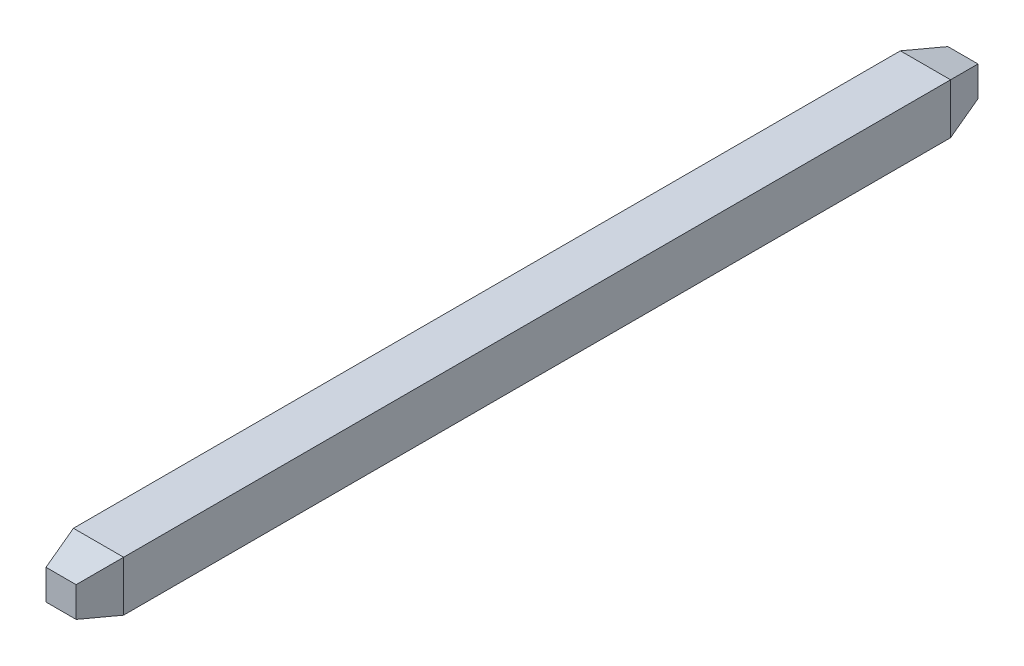
ISO-10303-21;
HEADER;
FILE_DESCRIPTION(('STEP AP214'),'2;1');
FILE_NAME('part.step','',(''),(''),'','','');
FILE_SCHEMA(('AUTOMOTIVE_DESIGN { 1 0 10303 214 1 1 1 1 }'));
ENDSEC;
DATA;
#1=APPLICATION_CONTEXT('core data for automotive mechanical design processes');
#2=APPLICATION_PROTOCOL_DEFINITION('international standard','automotive_design',2000,#1);
#3=PRODUCT_CONTEXT('',#1,'mechanical');
#4=PRODUCT('Part','Part','',(#3));
#5=PRODUCT_RELATED_PRODUCT_CATEGORY('part','',(#4));
#6=PRODUCT_DEFINITION_FORMATION('','',#4);
#7=PRODUCT_DEFINITION_CONTEXT('part definition',#1,'design');
#8=PRODUCT_DEFINITION('design','',#6,#7);
#9=PRODUCT_DEFINITION_SHAPE('','',#8);
#10=(LENGTH_UNIT() NAMED_UNIT(*) SI_UNIT(.MILLI.,.METRE.));
#11=(NAMED_UNIT(*) PLANE_ANGLE_UNIT() SI_UNIT($,.RADIAN.));
#12=(NAMED_UNIT(*) SI_UNIT($,.STERADIAN.) SOLID_ANGLE_UNIT());
#13=UNCERTAINTY_MEASURE_WITH_UNIT(LENGTH_MEASURE(1.E-05),#10,'distance_accuracy_value','');
#14=(GEOMETRIC_REPRESENTATION_CONTEXT(3) GLOBAL_UNCERTAINTY_ASSIGNED_CONTEXT((#13)) GLOBAL_UNIT_ASSIGNED_CONTEXT((#10,
#11,#12)) REPRESENTATION_CONTEXT('',''));
#15=CARTESIAN_POINT('',(0.,0.,0.));
#16=DIRECTION('',(0.,0.,1.));
#17=DIRECTION('',(1.,0.,0.));
#18=AXIS2_PLACEMENT_3D('',#15,#16,#17);
#19=CARTESIAN_POINT('',(6.08859499326237,2.21999999999989,7.92229749663118));
#20=DIRECTION('',(0.,-0.965925826289069,0.25881904510252));
#21=DIRECTION('',(0.,-0.25881904510252,-0.965925826289069));
#22=AXIS2_PLACEMENT_3D('',#19,#20,#21);
#23=PLANE('',#22);
#24=DIRECTION('',(1.,0.,0.));
#25=VECTOR('',#24,1.);
#26=CARTESIAN_POINT('',(7.62,2.34799999999989,8.4));
#27=LINE('',#26,#25);
#28=CARTESIAN_POINT('',(7.428,2.34799999999989,8.4));
#29=VERTEX_POINT('',#28);
#30=CARTESIAN_POINT('',(7.812,2.34799999999989,8.4));
#31=VERTEX_POINT('',#30);
#32=EDGE_CURVE('E20',#29,#31,#27,.T.);
#33=ORIENTED_EDGE('',*,*,#32,.F.);
#34=DIRECTION('',(0.250562807085731,0.25056280708573,0.93511312653103));
#35=VECTOR('',#34,1.);
#36=CARTESIAN_POINT('',(7.3,2.21999999999989,7.92229749663118));
#37=LINE('',#36,#35);
#38=CARTESIAN_POINT('',(7.3,2.21999999999989,7.92229749663118));
#39=VERTEX_POINT('',#38);
#40=EDGE_CURVE('E110',#39,#29,#37,.T.);
#41=ORIENTED_EDGE('',*,*,#40,.F.);
#42=DIRECTION('',(1.,0.,0.));
#43=VECTOR('',#42,1.);
#44=CARTESIAN_POINT('',(7.3,2.21999999999989,7.92229749663118));
#45=LINE('',#44,#43);
#46=CARTESIAN_POINT('',(7.94,2.21999999999989,7.92229749663118));
#47=VERTEX_POINT('',#46);
#48=EDGE_CURVE('E96',#47,#39,#45,.F.);
#49=ORIENTED_EDGE('',*,*,#48,.F.);
#50=DIRECTION('',(0.250562807085732,-0.25056280708573,-0.93511312653103));
#51=VECTOR('',#50,1.);
#52=CARTESIAN_POINT('',(7.812,2.34799999999989,8.4));
#53=LINE('',#52,#51);
#54=EDGE_CURVE('E94',#31,#47,#53,.T.);
#55=ORIENTED_EDGE('',*,*,#54,.F.);
#56=EDGE_LOOP('',(#33,#41,#49,#55));
#57=FACE_BOUND('',#56,.T.);
#58=ADVANCED_FACE('F17',(#57),#23,.T.);
#59=CARTESIAN_POINT('',(6.08859499326237,2.21999999999989,-2.62229749663118));
#60=DIRECTION('',(0.,0.965925826289068,0.258819045102521));
#61=DIRECTION('',(0.,-0.258819045102521,0.965925826289068));
#62=AXIS2_PLACEMENT_3D('',#59,#60,#61);
#63=PLANE('',#62);
#64=DIRECTION('',(0.250562807085733,0.25056280708573,-0.93511312653103));
#65=VECTOR('',#64,1.);
#66=CARTESIAN_POINT('',(7.3,2.21999999999989,-2.62229749663118));
#67=LINE('',#66,#65);
#68=CARTESIAN_POINT('',(7.3,2.21999999999989,-2.62229749663118));
#69=VERTEX_POINT('',#68);
#70=CARTESIAN_POINT('',(7.428,2.34799999999989,-3.1));
#71=VERTEX_POINT('',#70);
#72=EDGE_CURVE('E113',#69,#71,#67,.T.);
#73=ORIENTED_EDGE('',*,*,#72,.T.);
#74=DIRECTION('',(1.,0.,0.));
#75=VECTOR('',#74,1.);
#76=CARTESIAN_POINT('',(7.62,2.34799999999989,-3.1));
#77=LINE('',#76,#75);
#78=CARTESIAN_POINT('',(7.812,2.34799999999989,-3.1));
#79=VERTEX_POINT('',#78);
#80=EDGE_CURVE('E79',#71,#79,#77,.T.);
#81=ORIENTED_EDGE('',*,*,#80,.T.);
#82=DIRECTION('',(0.250562807085734,-0.25056280708573,0.935113126531029));
#83=VECTOR('',#82,1.);
#84=CARTESIAN_POINT('',(7.812,2.34799999999989,-3.1));
#85=LINE('',#84,#83);
#86=CARTESIAN_POINT('',(7.94,2.21999999999989,-2.62229749663118));
#87=VERTEX_POINT('',#86);
#88=EDGE_CURVE('E108',#79,#87,#85,.T.);
#89=ORIENTED_EDGE('',*,*,#88,.T.);
#90=DIRECTION('',(1.,0.,0.));
#91=VECTOR('',#90,1.);
#92=CARTESIAN_POINT('',(7.3,2.21999999999989,-2.62229749663118));
#93=LINE('',#92,#91);
#94=EDGE_CURVE('E118',#69,#87,#93,.T.);
#95=ORIENTED_EDGE('',*,*,#94,.F.);
#96=EDGE_LOOP('',(#73,#81,#89,#95));
#97=FACE_BOUND('',#96,.T.);
#98=ADVANCED_FACE('F281',(#97),#63,.F.);
#99=CARTESIAN_POINT('',(7.62,2.53999999999989,8.4));
#100=DIRECTION('',(0.,0.,1.));
#101=DIRECTION('',(1.,0.,0.));
#102=AXIS2_PLACEMENT_3D('',#99,#100,#101);
#103=PLANE('',#102);
#104=ORIENTED_EDGE('',*,*,#32,.T.);
#105=DIRECTION('',(0.,1.,0.));
#106=VECTOR('',#105,1.);
#107=CARTESIAN_POINT('',(7.812,1.00859499326226,8.4));
#108=LINE('',#107,#106);
#109=CARTESIAN_POINT('',(7.812,2.73199999999989,8.4));
#110=VERTEX_POINT('',#109);
#111=EDGE_CURVE('E88',#110,#31,#108,.F.);
#112=ORIENTED_EDGE('',*,*,#111,.F.);
#113=DIRECTION('',(1.,0.,0.));
#114=VECTOR('',#113,1.);
#115=CARTESIAN_POINT('',(9.15140500673763,2.73199999999989,8.4));
#116=LINE('',#115,#114);
#117=CARTESIAN_POINT('',(7.428,2.73199999999989,8.4));
#118=VERTEX_POINT('',#117);
#119=EDGE_CURVE('E124',#118,#110,#116,.T.);
#120=ORIENTED_EDGE('',*,*,#119,.F.);
#121=DIRECTION('',(0.,1.,0.));
#122=VECTOR('',#121,1.);
#123=CARTESIAN_POINT('',(7.428,4.07140500673752,8.4));
#124=LINE('',#123,#122);
#125=EDGE_CURVE('E90',#29,#118,#124,.T.);
#126=ORIENTED_EDGE('',*,*,#125,.F.);
#127=EDGE_LOOP('',(#104,#112,#120,#126));
#128=FACE_BOUND('',#127,.T.);
#129=ADVANCED_FACE('F85',(#128),#103,.T.);
#130=CARTESIAN_POINT('',(7.94,1.00859499326226,7.92229749663118));
#131=DIRECTION('',(0.965925826289069,0.,0.25881904510252));
#132=DIRECTION('',(0.25881904510252,0.,-0.965925826289069));
#133=AXIS2_PLACEMENT_3D('',#130,#131,#132);
#134=PLANE('',#133);
#135=ORIENTED_EDGE('',*,*,#111,.T.);
#136=ORIENTED_EDGE('',*,*,#54,.T.);
#137=DIRECTION('',(0.,1.,0.));
#138=VECTOR('',#137,1.);
#139=CARTESIAN_POINT('',(7.94,2.21999999999989,7.92229749663118));
#140=LINE('',#139,#138);
#141=CARTESIAN_POINT('',(7.94,2.85999999999989,7.92229749663118));
#142=VERTEX_POINT('',#141);
#143=EDGE_CURVE('E127',#142,#47,#140,.F.);
#144=ORIENTED_EDGE('',*,*,#143,.F.);
#145=DIRECTION('',(0.25056280708573,0.25056280708573,-0.93511312653103));
#146=VECTOR('',#145,1.);
#147=CARTESIAN_POINT('',(7.812,2.73199999999989,8.4));
#148=LINE('',#147,#146);
#149=EDGE_CURVE('E102',#110,#142,#148,.T.);
#150=ORIENTED_EDGE('',*,*,#149,.F.);
#151=EDGE_LOOP('',(#135,#136,#144,#150));
#152=FACE_BOUND('',#151,.T.);
#153=ADVANCED_FACE('F100',(#152),#134,.T.);
#154=CARTESIAN_POINT('',(7.62,2.53999999999989,-3.1));
#155=DIRECTION('',(0.,0.,1.));
#156=DIRECTION('',(1.,0.,0.));
#157=AXIS2_PLACEMENT_3D('',#154,#155,#156);
#158=PLANE('',#157);
#159=DIRECTION('',(0.,1.,0.));
#160=VECTOR('',#159,1.);
#161=CARTESIAN_POINT('',(7.812,1.00859499326226,-3.1));
#162=LINE('',#161,#160);
#163=CARTESIAN_POINT('',(7.812,2.73199999999989,-3.1));
#164=VERTEX_POINT('',#163);
#165=EDGE_CURVE('E106',#164,#79,#162,.F.);
#166=ORIENTED_EDGE('',*,*,#165,.T.);
#167=ORIENTED_EDGE('',*,*,#80,.F.);
#168=DIRECTION('',(0.,1.,0.));
#169=VECTOR('',#168,1.);
#170=CARTESIAN_POINT('',(7.428,4.07140500673752,-3.1));
#171=LINE('',#170,#169);
#172=CARTESIAN_POINT('',(7.428,2.73199999999989,-3.1));
#173=VERTEX_POINT('',#172);
#174=EDGE_CURVE('E115',#71,#173,#171,.T.);
#175=ORIENTED_EDGE('',*,*,#174,.T.);
#176=DIRECTION('',(1.,0.,0.));
#177=VECTOR('',#176,1.);
#178=CARTESIAN_POINT('',(9.15140500673763,2.73199999999989,-3.1));
#179=LINE('',#178,#177);
#180=EDGE_CURVE('E138',#173,#164,#179,.T.);
#181=ORIENTED_EDGE('',*,*,#180,.T.);
#182=EDGE_LOOP('',(#166,#167,#175,#181));
#183=FACE_BOUND('',#182,.T.);
#184=ADVANCED_FACE('F257',(#183),#158,.F.);
#185=CARTESIAN_POINT('',(7.94,1.00859499326226,-2.62229749663118));
#186=DIRECTION('',(-0.965925826289068,0.,0.258819045102521));
#187=DIRECTION('',(0.258819045102521,0.,0.965925826289068));
#188=AXIS2_PLACEMENT_3D('',#185,#186,#187);
#189=PLANE('',#188);
#190=ORIENTED_EDGE('',*,*,#88,.F.);
#191=ORIENTED_EDGE('',*,*,#165,.F.);
#192=DIRECTION('',(0.25056280708573,0.250562807085732,0.93511312653103));
#193=VECTOR('',#192,1.);
#194=CARTESIAN_POINT('',(7.812,2.73199999999989,-3.1));
#195=LINE('',#194,#193);
#196=CARTESIAN_POINT('',(7.94,2.85999999999989,-2.62229749663118));
#197=VERTEX_POINT('',#196);
#198=EDGE_CURVE('E140',#164,#197,#195,.T.);
#199=ORIENTED_EDGE('',*,*,#198,.T.);
#200=DIRECTION('',(0.,1.,0.));
#201=VECTOR('',#200,1.);
#202=CARTESIAN_POINT('',(7.94,2.21999999999989,-2.62229749663118));
#203=LINE('',#202,#201);
#204=EDGE_CURVE('E133',#87,#197,#203,.T.);
#205=ORIENTED_EDGE('',*,*,#204,.F.);
#206=EDGE_LOOP('',(#190,#191,#199,#205));
#207=FACE_BOUND('',#206,.T.);
#208=ADVANCED_FACE('F249',(#207),#189,.F.);
#209=CARTESIAN_POINT('',(7.3,4.07140500673752,7.92229749663118));
#210=DIRECTION('',(-0.965925826289069,0.,0.25881904510252));
#211=DIRECTION('',(0.25881904510252,0.,0.965925826289069));
#212=AXIS2_PLACEMENT_3D('',#209,#210,#211);
#213=PLANE('',#212);
#214=ORIENTED_EDGE('',*,*,#125,.T.);
#215=DIRECTION('',(0.250562807085729,-0.250562807085731,0.93511312653103));
#216=VECTOR('',#215,1.);
#217=CARTESIAN_POINT('',(7.3,2.85999999999989,7.92229749663118));
#218=LINE('',#217,#216);
#219=CARTESIAN_POINT('',(7.3,2.85999999999989,7.92229749663118));
#220=VERTEX_POINT('',#219);
#221=EDGE_CURVE('E121',#220,#118,#218,.T.);
#222=ORIENTED_EDGE('',*,*,#221,.F.);
#223=DIRECTION('',(0.,-1.,0.));
#224=VECTOR('',#223,1.);
#225=CARTESIAN_POINT('',(7.3,2.85999999999989,7.92229749663118));
#226=LINE('',#225,#224);
#227=EDGE_CURVE('E142',#39,#220,#226,.F.);
#228=ORIENTED_EDGE('',*,*,#227,.F.);
#229=ORIENTED_EDGE('',*,*,#40,.T.);
#230=EDGE_LOOP('',(#214,#222,#228,#229));
#231=FACE_BOUND('',#230,.T.);
#232=ADVANCED_FACE('F171',(#231),#213,.T.);
#233=CARTESIAN_POINT('',(7.3,4.07140500673752,-2.62229749663118));
#234=DIRECTION('',(0.965925826289068,0.,0.258819045102521));
#235=DIRECTION('',(0.258819045102521,0.,-0.965925826289068));
#236=AXIS2_PLACEMENT_3D('',#233,#234,#235);
#237=PLANE('',#236);
#238=DIRECTION('',(0.250562807085729,-0.250562807085732,-0.93511312653103));
#239=VECTOR('',#238,1.);
#240=CARTESIAN_POINT('',(7.3,2.85999999999989,-2.62229749663118));
#241=LINE('',#240,#239);
#242=CARTESIAN_POINT('',(7.3,2.85999999999989,-2.62229749663118));
#243=VERTEX_POINT('',#242);
#244=EDGE_CURVE('E136',#243,#173,#241,.T.);
#245=ORIENTED_EDGE('',*,*,#244,.T.);
#246=ORIENTED_EDGE('',*,*,#174,.F.);
#247=ORIENTED_EDGE('',*,*,#72,.F.);
#248=DIRECTION('',(0.,-1.,0.));
#249=VECTOR('',#248,1.);
#250=CARTESIAN_POINT('',(7.3,2.85999999999989,-2.62229749663118));
#251=LINE('',#250,#249);
#252=EDGE_CURVE('E35',#243,#69,#251,.T.);
#253=ORIENTED_EDGE('',*,*,#252,.F.);
#254=EDGE_LOOP('',(#245,#246,#247,#253));
#255=FACE_BOUND('',#254,.T.);
#256=ADVANCED_FACE('F188',(#255),#237,.F.);
#257=CARTESIAN_POINT('',(7.3,2.21999999999989,-3.1));
#258=DIRECTION('',(0.,-1.,0.));
#259=DIRECTION('',(1.,0.,0.));
#260=AXIS2_PLACEMENT_3D('',#257,#258,#259);
#261=PLANE('',#260);
#262=ORIENTED_EDGE('',*,*,#94,.T.);
#263=DIRECTION('',(0.,0.,1.));
#264=VECTOR('',#263,1.);
#265=CARTESIAN_POINT('',(7.94,2.21999999999989,-3.1));
#266=LINE('',#265,#264);
#267=EDGE_CURVE('E130',#47,#87,#266,.F.);
#268=ORIENTED_EDGE('',*,*,#267,.F.);
#269=ORIENTED_EDGE('',*,*,#48,.T.);
#270=DIRECTION('',(0.,0.,1.));
#271=VECTOR('',#270,1.);
#272=CARTESIAN_POINT('',(7.3,2.21999999999989,-3.1));
#273=LINE('',#272,#271);
#274=EDGE_CURVE('E146',#69,#39,#273,.T.);
#275=ORIENTED_EDGE('',*,*,#274,.F.);
#276=EDGE_LOOP('',(#262,#268,#269,#275));
#277=FACE_BOUND('',#276,.T.);
#278=ADVANCED_FACE('F174',(#277),#261,.T.);
#279=CARTESIAN_POINT('',(9.15140500673763,2.85999999999989,7.92229749663118));
#280=DIRECTION('',(0.,0.965925826289069,0.25881904510252));
#281=DIRECTION('',(0.,-0.25881904510252,0.965925826289069));
#282=AXIS2_PLACEMENT_3D('',#279,#280,#281);
#283=PLANE('',#282);
#284=ORIENTED_EDGE('',*,*,#119,.T.);
#285=ORIENTED_EDGE('',*,*,#149,.T.);
#286=DIRECTION('',(-1.,0.,0.));
#287=VECTOR('',#286,1.);
#288=CARTESIAN_POINT('',(7.94,2.85999999999989,7.92229749663118));
#289=LINE('',#288,#287);
#290=EDGE_CURVE('E149',#220,#142,#289,.F.);
#291=ORIENTED_EDGE('',*,*,#290,.F.);
#292=ORIENTED_EDGE('',*,*,#221,.T.);
#293=EDGE_LOOP('',(#284,#285,#291,#292));
#294=FACE_BOUND('',#293,.T.);
#295=ADVANCED_FACE('F179',(#294),#283,.T.);
#296=CARTESIAN_POINT('',(7.94,2.21999999999989,-3.1));
#297=DIRECTION('',(1.,0.,0.));
#298=DIRECTION('',(0.,1.,0.));
#299=AXIS2_PLACEMENT_3D('',#296,#297,#298);
#300=PLANE('',#299);
#301=ORIENTED_EDGE('',*,*,#204,.T.);
#302=DIRECTION('',(0.,0.,1.));
#303=VECTOR('',#302,1.);
#304=CARTESIAN_POINT('',(7.94,2.85999999999989,-3.1));
#305=LINE('',#304,#303);
#306=EDGE_CURVE('E152',#142,#197,#305,.F.);
#307=ORIENTED_EDGE('',*,*,#306,.F.);
#308=ORIENTED_EDGE('',*,*,#143,.T.);
#309=ORIENTED_EDGE('',*,*,#267,.T.);
#310=EDGE_LOOP('',(#301,#307,#308,#309));
#311=FACE_BOUND('',#310,.T.);
#312=ADVANCED_FACE('F177',(#311),#300,.T.);
#313=CARTESIAN_POINT('',(9.15140500673763,2.85999999999989,-2.62229749663118));
#314=DIRECTION('',(0.,-0.965925826289068,0.258819045102521));
#315=DIRECTION('',(0.,-0.258819045102521,-0.965925826289068));
#316=AXIS2_PLACEMENT_3D('',#313,#314,#315);
#317=PLANE('',#316);
#318=ORIENTED_EDGE('',*,*,#198,.F.);
#319=ORIENTED_EDGE('',*,*,#180,.F.);
#320=ORIENTED_EDGE('',*,*,#244,.F.);
#321=DIRECTION('',(-1.,0.,0.));
#322=VECTOR('',#321,1.);
#323=CARTESIAN_POINT('',(7.94,2.85999999999989,-2.62229749663118));
#324=LINE('',#323,#322);
#325=EDGE_CURVE('E26',#197,#243,#324,.T.);
#326=ORIENTED_EDGE('',*,*,#325,.F.);
#327=EDGE_LOOP('',(#318,#319,#320,#326));
#328=FACE_BOUND('',#327,.T.);
#329=ADVANCED_FACE('F163',(#328),#317,.F.);
#330=CARTESIAN_POINT('',(7.3,2.85999999999989,-3.1));
#331=DIRECTION('',(-1.,0.,0.));
#332=DIRECTION('',(0.,-1.,0.));
#333=AXIS2_PLACEMENT_3D('',#330,#331,#332);
#334=PLANE('',#333);
#335=ORIENTED_EDGE('',*,*,#252,.T.);
#336=ORIENTED_EDGE('',*,*,#274,.T.);
#337=ORIENTED_EDGE('',*,*,#227,.T.);
#338=DIRECTION('',(0.,0.,1.));
#339=VECTOR('',#338,1.);
#340=CARTESIAN_POINT('',(7.3,2.85999999999989,-3.1));
#341=LINE('',#340,#339);
#342=EDGE_CURVE('E11',#243,#220,#341,.T.);
#343=ORIENTED_EDGE('',*,*,#342,.F.);
#344=EDGE_LOOP('',(#335,#336,#337,#343));
#345=FACE_BOUND('',#344,.T.);
#346=ADVANCED_FACE('F167',(#345),#334,.T.);
#347=CARTESIAN_POINT('',(7.94,2.85999999999989,-3.1));
#348=DIRECTION('',(0.,1.,0.));
#349=DIRECTION('',(-1.,0.,0.));
#350=AXIS2_PLACEMENT_3D('',#347,#348,#349);
#351=PLANE('',#350);
#352=ORIENTED_EDGE('',*,*,#325,.T.);
#353=ORIENTED_EDGE('',*,*,#342,.T.);
#354=ORIENTED_EDGE('',*,*,#290,.T.);
#355=ORIENTED_EDGE('',*,*,#306,.T.);
#356=EDGE_LOOP('',(#352,#353,#354,#355));
#357=FACE_BOUND('',#356,.T.);
#358=ADVANCED_FACE('F158',(#357),#351,.T.);
#359=CLOSED_SHELL('',(#58,#98,#129,#153,#184,#208,#232,#256,#278,#295,#312,#329,#346,#358));
#360=MANIFOLD_SOLID_BREP('B1',#359);
#361=ADVANCED_BREP_SHAPE_REPRESENTATION('',(#18,#360),#14);
#362=SHAPE_DEFINITION_REPRESENTATION(#9,#361);
ENDSEC;
END-ISO-10303-21;
